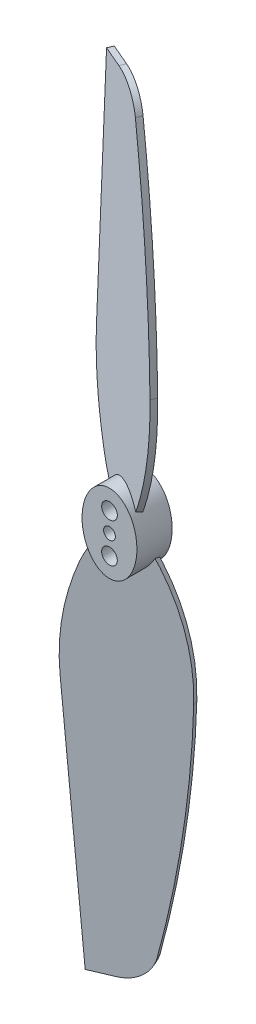
ISO-10303-21;
HEADER;
FILE_DESCRIPTION(('STEP AP214'),'2;1');
FILE_NAME('part.step','',(''),(''),'','','');
FILE_SCHEMA(('AUTOMOTIVE_DESIGN { 1 0 10303 214 1 1 1 1 }'));
ENDSEC;
DATA;
#1=APPLICATION_CONTEXT('core data for automotive mechanical design processes');
#2=APPLICATION_PROTOCOL_DEFINITION('international standard','automotive_design',2000,#1);
#3=PRODUCT_CONTEXT('',#1,'mechanical');
#4=PRODUCT('Part','Part','',(#3));
#5=PRODUCT_RELATED_PRODUCT_CATEGORY('part','',(#4));
#6=PRODUCT_DEFINITION_FORMATION('','',#4);
#7=PRODUCT_DEFINITION_CONTEXT('part definition',#1,'design');
#8=PRODUCT_DEFINITION('design','',#6,#7);
#9=PRODUCT_DEFINITION_SHAPE('','',#8);
#10=(LENGTH_UNIT() NAMED_UNIT(*) SI_UNIT(.MILLI.,.METRE.));
#11=(NAMED_UNIT(*) PLANE_ANGLE_UNIT() SI_UNIT($,.RADIAN.));
#12=(NAMED_UNIT(*) SI_UNIT($,.STERADIAN.) SOLID_ANGLE_UNIT());
#13=UNCERTAINTY_MEASURE_WITH_UNIT(LENGTH_MEASURE(1.E-05),#10,'distance_accuracy_value','');
#14=(GEOMETRIC_REPRESENTATION_CONTEXT(3) GLOBAL_UNCERTAINTY_ASSIGNED_CONTEXT((#13)) GLOBAL_UNIT_ASSIGNED_CONTEXT((#10,
#11,#12)) REPRESENTATION_CONTEXT('',''));
#15=CARTESIAN_POINT('',(0.,0.,0.));
#16=DIRECTION('',(0.,0.,1.));
#17=DIRECTION('',(1.,0.,0.));
#18=AXIS2_PLACEMENT_3D('',#15,#16,#17);
#19=CARTESIAN_POINT('',(0.,0.,4.5));
#20=DIRECTION('',(0.,0.,1.));
#21=DIRECTION('',(0.,1.,0.));
#22=AXIS2_PLACEMENT_3D('',#19,#20,#21);
#23=ELLIPSE('',#22,5.,3.5);
#24=DIRECTION('',(0.,0.,-1.));
#25=VECTOR('',#24,1.);
#26=SURFACE_OF_LINEAR_EXTRUSION('',#23,#25);
#27=CARTESIAN_POINT('',(0.,0.,0.));
#28=DIRECTION('',(0.,0.,1.));
#29=DIRECTION('',(0.,1.,0.));
#30=AXIS2_PLACEMENT_3D('',#27,#28,#29);
#31=ELLIPSE('',#30,5.,3.5);
#32=CARTESIAN_POINT('',(0.,5.,0.));
#33=VERTEX_POINT('',#32);
#34=EDGE_CURVE('E66',#33,#33,#31,.T.);
#35=ORIENTED_EDGE('',*,*,#34,.T.);
#36=EDGE_LOOP('',(#35));
#37=FACE_BOUND('',#36,.T.);
#38=CARTESIAN_POINT('',(0.,5.,4.5));
#39=VERTEX_POINT('',#38);
#40=EDGE_CURVE('E11',#39,#39,#23,.T.);
#41=ORIENTED_EDGE('',*,*,#40,.F.);
#42=EDGE_LOOP('',(#41));
#43=FACE_BOUND('',#42,.T.);
#44=ADVANCED_FACE('F58',(#37,#43),#26,.F.);
#45=CARTESIAN_POINT('',(0.,0.,4.5));
#46=DIRECTION('',(0.,0.,1.));
#47=DIRECTION('',(1.,0.,0.));
#48=AXIS2_PLACEMENT_3D('',#45,#46,#47);
#49=PLANE('',#48);
#50=CARTESIAN_POINT('',(0.,0.,4.5));
#51=DIRECTION('',(0.,0.,1.));
#52=DIRECTION('',(1.,0.,0.));
#53=AXIS2_PLACEMENT_3D('',#50,#51,#52);
#54=CIRCLE('',#53,0.75);
#55=CARTESIAN_POINT('',(0.75,0.,4.5));
#56=VERTEX_POINT('',#55);
#57=EDGE_CURVE('E79',#56,#56,#54,.T.);
#58=ORIENTED_EDGE('',*,*,#57,.F.);
#59=EDGE_LOOP('',(#58));
#60=FACE_BOUND('',#59,.T.);
#61=CARTESIAN_POINT('',(0.,2.5,4.5));
#62=DIRECTION('',(0.,0.,1.));
#63=DIRECTION('',(1.,0.,0.));
#64=AXIS2_PLACEMENT_3D('',#61,#62,#63);
#65=CIRCLE('',#64,1.);
#66=CARTESIAN_POINT('',(1.,2.5,4.5));
#67=VERTEX_POINT('',#66);
#68=EDGE_CURVE('E125',#67,#67,#65,.T.);
#69=ORIENTED_EDGE('',*,*,#68,.F.);
#70=EDGE_LOOP('',(#69));
#71=FACE_BOUND('',#70,.T.);
#72=CARTESIAN_POINT('',(0.,-2.5,4.5));
#73=DIRECTION('',(0.,0.,1.));
#74=DIRECTION('',(1.,0.,0.));
#75=AXIS2_PLACEMENT_3D('',#72,#73,#74);
#76=CIRCLE('',#75,1.);
#77=CARTESIAN_POINT('',(1.,-2.5,4.5));
#78=VERTEX_POINT('',#77);
#79=EDGE_CURVE('E73',#78,#78,#76,.T.);
#80=ORIENTED_EDGE('',*,*,#79,.F.);
#81=EDGE_LOOP('',(#80));
#82=FACE_BOUND('',#81,.T.);
#83=ORIENTED_EDGE('',*,*,#40,.T.);
#84=EDGE_LOOP('',(#83));
#85=FACE_BOUND('',#84,.T.);
#86=ADVANCED_FACE('F101',(#60,#71,#82,#85),#49,.T.);
#87=CARTESIAN_POINT('',(0.,0.,0.));
#88=DIRECTION('',(0.,0.,1.));
#89=DIRECTION('',(1.,0.,0.));
#90=AXIS2_PLACEMENT_3D('',#87,#88,#89);
#91=PLANE('',#90);
#92=CARTESIAN_POINT('',(0.,0.,0.));
#93=DIRECTION('',(0.,0.,1.));
#94=DIRECTION('',(1.,0.,0.));
#95=AXIS2_PLACEMENT_3D('',#92,#93,#94);
#96=CIRCLE('',#95,0.75);
#97=CARTESIAN_POINT('',(0.75,0.,0.));
#98=VERTEX_POINT('',#97);
#99=EDGE_CURVE('E62',#98,#98,#96,.T.);
#100=ORIENTED_EDGE('',*,*,#99,.T.);
#101=EDGE_LOOP('',(#100));
#102=FACE_BOUND('',#101,.T.);
#103=CARTESIAN_POINT('',(0.,2.5,0.));
#104=DIRECTION('',(0.,0.,1.));
#105=DIRECTION('',(1.,0.,0.));
#106=AXIS2_PLACEMENT_3D('',#103,#104,#105);
#107=CIRCLE('',#106,1.);
#108=CARTESIAN_POINT('',(1.,2.5,0.));
#109=VERTEX_POINT('',#108);
#110=EDGE_CURVE('E78',#109,#109,#107,.T.);
#111=ORIENTED_EDGE('',*,*,#110,.T.);
#112=EDGE_LOOP('',(#111));
#113=FACE_BOUND('',#112,.T.);
#114=CARTESIAN_POINT('',(0.,-2.5,0.));
#115=DIRECTION('',(0.,0.,1.));
#116=DIRECTION('',(1.,0.,0.));
#117=AXIS2_PLACEMENT_3D('',#114,#115,#116);
#118=CIRCLE('',#117,1.);
#119=CARTESIAN_POINT('',(1.,-2.5,0.));
#120=VERTEX_POINT('',#119);
#121=EDGE_CURVE('E76',#120,#120,#118,.T.);
#122=ORIENTED_EDGE('',*,*,#121,.T.);
#123=EDGE_LOOP('',(#122));
#124=FACE_BOUND('',#123,.T.);
#125=ORIENTED_EDGE('',*,*,#34,.F.);
#126=EDGE_LOOP('',(#125));
#127=FACE_BOUND('',#126,.T.);
#128=ADVANCED_FACE('F86',(#102,#113,#124,#127),#91,.F.);
#129=CARTESIAN_POINT('',(0.,-2.5,-0.689462870256029));
#130=DIRECTION('',(0.,0.,1.));
#131=DIRECTION('',(1.,0.,0.));
#132=AXIS2_PLACEMENT_3D('',#129,#130,#131);
#133=CYLINDRICAL_SURFACE('',#132,1.);
#134=ORIENTED_EDGE('',*,*,#79,.T.);
#135=EDGE_LOOP('',(#134));
#136=FACE_BOUND('',#135,.T.);
#137=ORIENTED_EDGE('',*,*,#121,.F.);
#138=EDGE_LOOP('',(#137));
#139=FACE_BOUND('',#138,.T.);
#140=ADVANCED_FACE('F96',(#136,#139),#133,.F.);
#141=CARTESIAN_POINT('',(0.,2.5,-0.689462870256029));
#142=DIRECTION('',(0.,0.,1.));
#143=DIRECTION('',(1.,0.,0.));
#144=AXIS2_PLACEMENT_3D('',#141,#142,#143);
#145=CYLINDRICAL_SURFACE('',#144,1.);
#146=ORIENTED_EDGE('',*,*,#68,.T.);
#147=EDGE_LOOP('',(#146));
#148=FACE_BOUND('',#147,.T.);
#149=ORIENTED_EDGE('',*,*,#110,.F.);
#150=EDGE_LOOP('',(#149));
#151=FACE_BOUND('',#150,.T.);
#152=ADVANCED_FACE('F90',(#148,#151),#145,.F.);
#153=CARTESIAN_POINT('',(0.,0.,-0.689462870256029));
#154=DIRECTION('',(0.,0.,1.));
#155=DIRECTION('',(1.,0.,0.));
#156=AXIS2_PLACEMENT_3D('',#153,#154,#155);
#157=CYLINDRICAL_SURFACE('',#156,0.75);
#158=ORIENTED_EDGE('',*,*,#57,.T.);
#159=EDGE_LOOP('',(#158));
#160=FACE_BOUND('',#159,.T.);
#161=ORIENTED_EDGE('',*,*,#99,.F.);
#162=EDGE_LOOP('',(#161));
#163=FACE_BOUND('',#162,.T.);
#164=ADVANCED_FACE('F88',(#160,#163),#157,.F.);
#165=CLOSED_SHELL('',(#44,#86,#128,#140,#152,#164));
#166=MANIFOLD_SOLID_BREP('B2',#165);
#167=CARTESIAN_POINT('',(1.3145287411941,0.,2.27814653766199));
#168=DIRECTION('',(0.,1.,0.));
#169=DIRECTION('',(-0.724137930705924,0.,-0.68965517275878));
#170=AXIS2_PLACEMENT_3D('',#167,#168,#169);
#171=PLANE('',#170);
#172=DIRECTION('',(0.,0.,1.));
#173=VECTOR('',#172,1.);
#174=CARTESIAN_POINT('',(-0.75,0.,-0.689462870256029));
#175=LINE('',#174,#173);
#176=CARTESIAN_POINT('',(-0.749999999999999,0.,2.34696887869071));
#177=VERTEX_POINT('',#176);
#178=CARTESIAN_POINT('',(-0.75,0.,2.53809487809043));
#179=VERTEX_POINT('',#178);
#180=EDGE_CURVE('E331',#177,#179,#175,.T.);
#181=ORIENTED_EDGE('',*,*,#180,.F.);
#182=DIRECTION('',(-0.919145030205725,0.,0.393919298141278));
#183=VECTOR('',#182,1.);
#184=CARTESIAN_POINT('',(1.01908926758814,0.,1.5887877650077));
#185=LINE('',#184,#183);
#186=CARTESIAN_POINT('',(-0.819200792823308,0.,2.37662636129025));
#187=VERTEX_POINT('',#186);
#188=EDGE_CURVE('E305',#177,#187,#185,.T.);
#189=ORIENTED_EDGE('',*,*,#188,.T.);
#190=DIRECTION('',(-0.393919298141278,0.,-0.919145030205725));
#191=VECTOR('',#190,1.);
#192=CARTESIAN_POINT('',(-0.52376131921735,0.,3.06598513394455));
#193=LINE('',#192,#191);
#194=EDGE_CURVE('E312',#179,#187,#193,.T.);
#195=ORIENTED_EDGE('',*,*,#194,.F.);
#196=EDGE_LOOP('',(#181,#189,#195));
#197=FACE_BOUND('',#196,.T.);
#198=ADVANCED_FACE('F181',(#197),#171,.T.);
#199=CARTESIAN_POINT('',(21.9152398199257,-15.7156926478818,-6.55072962732023));
#200=DIRECTION('',(-0.393919298141278,0.,-0.919145030205725));
#201=DIRECTION('',(-0.919145030205725,0.,0.393919298141278));
#202=AXIS2_PLACEMENT_3D('',#199,#200,#201);
#203=CYLINDRICAL_SURFACE('',#202,30.);
#204=CARTESIAN_POINT('',(21.6198003463197,-15.7156926478818,-7.24008839997453));
#205=DIRECTION('',(0.393919298141278,0.,0.919145030205725));
#206=DIRECTION('',(-0.919145030205725,0.,0.393919298141278));
#207=AXIS2_PLACEMENT_3D('',#204,#205,#206);
#208=CIRCLE('',#207,30.);
#209=CARTESIAN_POINT('',(-4.13552137977223,-5.,3.79790661096967));
#210=VERTEX_POINT('',#209);
#211=CARTESIAN_POINT('',(-5.8744984589548,-18.,4.54318250106728));
#212=VERTEX_POINT('',#211);
#213=EDGE_CURVE('E291',#210,#212,#208,.T.);
#214=ORIENTED_EDGE('',*,*,#213,.T.);
#215=DIRECTION('',(-0.393919298141278,0.,-0.919145030205725));
#216=VECTOR('',#215,1.);
#217=CARTESIAN_POINT('',(-5.57905898534884,-18.,5.23254127372158));
#218=LINE('',#217,#216);
#219=CARTESIAN_POINT('',(-5.57905898534884,-18.,5.23254127372158));
#220=VERTEX_POINT('',#219);
#221=EDGE_CURVE('E290',#220,#212,#218,.T.);
#222=ORIENTED_EDGE('',*,*,#221,.F.);
#223=CARTESIAN_POINT('',(21.9152398199257,-15.7156926478818,-6.55072962732023));
#224=DIRECTION('',(0.393919298141278,0.,0.919145030205725));
#225=DIRECTION('',(-0.919145030205725,0.,0.393919298141278));
#226=AXIS2_PLACEMENT_3D('',#223,#224,#225);
#227=CIRCLE('',#226,30.);
#228=CARTESIAN_POINT('',(-3.84008190616627,-5.,4.48726538362396));
#229=VERTEX_POINT('',#228);
#230=EDGE_CURVE('E310',#229,#220,#227,.T.);
#231=ORIENTED_EDGE('',*,*,#230,.F.);
#232=DIRECTION('',(-0.393919298141278,0.,-0.919145030205725));
#233=VECTOR('',#232,1.);
#234=CARTESIAN_POINT('',(-3.84008190616627,-5.,4.48726538362396));
#235=LINE('',#234,#233);
#236=EDGE_CURVE('E189',#229,#210,#235,.T.);
#237=ORIENTED_EDGE('',*,*,#236,.T.);
#238=EDGE_LOOP('',(#214,#222,#231,#237));
#239=FACE_BOUND('',#238,.T.);
#240=ADVANCED_FACE('F183',(#239),#203,.T.);
#241=CARTESIAN_POINT('',(6.46204678427051,-9.28627705915271,0.0720673792462853));
#242=DIRECTION('',(-0.393919298141278,0.,-0.919145030205725));
#243=DIRECTION('',(-0.919145030205725,0.,0.393919298141278));
#244=AXIS2_PLACEMENT_3D('',#241,#242,#243);
#245=CYLINDRICAL_SURFACE('',#244,12.);
#246=CARTESIAN_POINT('',(-0.75,0.,2.53809487809043));
#247=CARTESIAN_POINT('',(-0.749996468598497,-0.0164378048235438,2.58908687690633));
#248=CARTESIAN_POINT('',(-0.749459645822779,-0.0326092065875987,2.64016267214185));
#249=CARTESIAN_POINT('',(-0.747397567067205,-0.0644396910591233,2.74243276950829));
#250=CARTESIAN_POINT('',(-0.745872686743596,-0.0800989660995931,2.79362701923538));
#251=CARTESIAN_POINT('',(-0.741912546858403,-0.110937937879825,2.89612307861109));
#252=CARTESIAN_POINT('',(-0.739477298974362,-0.126117640768485,2.94742488687164));
#253=CARTESIAN_POINT('',(-0.733750101990573,-0.15601889722111,3.05013551591533));
#254=CARTESIAN_POINT('',(-0.730457827728856,-0.170740274514427,3.10154436995264));
#255=CARTESIAN_POINT('',(-0.726764836807171,-0.185237339596115,3.15298664136786));
#256=B_SPLINE_CURVE_WITH_KNOTS('',3,(#246,#247,#248,#249,#250,#251,#252,#253,#254,#255),
.UNSPECIFIED.,.F.,.F.,(4,2,2,2,4),(0.,0.160721728299978,0.321382386550923,0.482040984032935,
0.642760625609639),.UNSPECIFIED.);
#257=CARTESIAN_POINT('',(-0.726764836806105,-0.185237339595355,3.15298664136811));
#258=VERTEX_POINT('',#257);
#259=EDGE_CURVE('E336',#179,#258,#256,.T.);
#260=ORIENTED_EDGE('',*,*,#259,.F.);
#261=ORIENTED_EDGE('',*,*,#194,.T.);
#262=CARTESIAN_POINT('',(6.16660731066455,-9.28627705915271,-0.61729139340801));
#263=DIRECTION('',(0.393919298141278,0.,0.919145030205725));
#264=DIRECTION('',(-0.919145030205725,0.,0.393919298141278));
#265=AXIS2_PLACEMENT_3D('',#262,#263,#264);
#266=CIRCLE('',#265,12.);
#267=EDGE_CURVE('E237',#187,#210,#266,.T.);
#268=ORIENTED_EDGE('',*,*,#267,.T.);
#269=ORIENTED_EDGE('',*,*,#236,.F.);
#270=CARTESIAN_POINT('',(6.46204678427051,-9.28627705915271,0.0720673792462853));
#271=DIRECTION('',(0.393919298141278,0.,0.919145030205725));
#272=DIRECTION('',(-0.919145030205725,0.,0.393919298141278));
#273=AXIS2_PLACEMENT_3D('',#270,#271,#272);
#274=CIRCLE('',#273,12.);
#275=EDGE_CURVE('E204',#258,#229,#274,.T.);
#276=ORIENTED_EDGE('',*,*,#275,.F.);
#277=EDGE_LOOP('',(#260,#261,#268,#269,#276));
#278=FACE_BOUND('',#277,.T.);
#279=ADVANCED_FACE('F346',(#278),#245,.T.);
#280=DIRECTION('',(0.,0.,1.));
#281=VECTOR('',#280,1.);
#282=CARTESIAN_POINT('',(0.75,0.,-0.689462870256029));
#283=LINE('',#282,#281);
#284=CARTESIAN_POINT('',(0.75,0.,2.52008742642683));
#285=VERTEX_POINT('',#284);
#286=CARTESIAN_POINT('',(0.750000000000001,0.,1.70411173667944));
#287=VERTEX_POINT('',#286);
#288=EDGE_CURVE('E195',#285,#287,#283,.F.);
#289=ORIENTED_EDGE('',*,*,#288,.F.);
#290=DIRECTION('',(-0.919145030205725,0.,0.393919298141278));
#291=VECTOR('',#290,1.);
#292=CARTESIAN_POINT('',(1.3145287411941,0.,2.27814653766199));
#293=LINE('',#292,#291);
#294=CARTESIAN_POINT('',(1.31452874119409,0.,2.278146537662));
#295=VERTEX_POINT('',#294);
#296=EDGE_CURVE('E284',#295,#285,#293,.T.);
#297=ORIENTED_EDGE('',*,*,#296,.F.);
#298=DIRECTION('',(-0.393919298141278,0.,-0.919145030205725));
#299=VECTOR('',#298,1.);
#300=CARTESIAN_POINT('',(1.31452874119409,0.,2.278146537662));
#301=LINE('',#300,#299);
#302=CARTESIAN_POINT('',(1.01908926758813,0.,1.5887877650077));
#303=VERTEX_POINT('',#302);
#304=EDGE_CURVE('E278',#295,#303,#301,.T.);
#305=ORIENTED_EDGE('',*,*,#304,.T.);
#306=EDGE_CURVE('E306',#303,#287,#185,.T.);
#307=ORIENTED_EDGE('',*,*,#306,.T.);
#308=EDGE_LOOP('',(#289,#297,#305,#307));
#309=FACE_BOUND('',#308,.T.);
#310=ADVANCED_FACE('F367',(#309),#171,.T.);
#311=CARTESIAN_POINT('',(-21.197524437125,-17.3240618265888,11.9261693156753));
#312=DIRECTION('',(-0.393919298141278,0.,-0.919145030205725));
#313=DIRECTION('',(-0.919145030205725,0.,0.393919298141278));
#314=AXIS2_PLACEMENT_3D('',#311,#312,#313);
#315=CYLINDRICAL_SURFACE('',#314,30.);
#316=CARTESIAN_POINT('',(-21.4929639107309,-17.3240618265888,11.236810543021));
#317=DIRECTION('',(-0.393919298141278,0.,-0.919145030205725));
#318=DIRECTION('',(0.919145030205725,0.,-0.393919298141278));
#319=AXIS2_PLACEMENT_3D('',#316,#317,#318);
#320=CIRCLE('',#319,30.);
#321=CARTESIAN_POINT('',(6.07438693371967,-18.,-0.577768374769338));
#322=VERTEX_POINT('',#321);
#323=EDGE_CURVE('E303',#303,#322,#320,.T.);
#324=ORIENTED_EDGE('',*,*,#323,.F.);
#325=ORIENTED_EDGE('',*,*,#304,.F.);
#326=CARTESIAN_POINT('',(-21.197524437125,-17.3240618265888,11.9261693156753));
#327=DIRECTION('',(-0.393919298141278,0.,-0.919145030205725));
#328=DIRECTION('',(0.919145030205725,0.,-0.393919298141278));
#329=AXIS2_PLACEMENT_3D('',#326,#327,#328);
#330=CIRCLE('',#329,30.);
#331=CARTESIAN_POINT('',(6.36982640732562,-18.,0.111590397884956));
#332=VERTEX_POINT('',#331);
#333=EDGE_CURVE('E263',#295,#332,#330,.T.);
#334=ORIENTED_EDGE('',*,*,#333,.T.);
#335=DIRECTION('',(-0.393919298141278,0.,-0.919145030205725));
#336=VECTOR('',#335,1.);
#337=CARTESIAN_POINT('',(6.36982640732562,-18.,0.111590397884956));
#338=LINE('',#337,#336);
#339=EDGE_CURVE('E272',#332,#322,#338,.T.);
#340=ORIENTED_EDGE('',*,*,#339,.T.);
#341=EDGE_LOOP('',(#324,#325,#334,#340));
#342=FACE_BOUND('',#341,.T.);
#343=ADVANCED_FACE('F281',(#342),#315,.T.);
#344=CARTESIAN_POINT('',(-127.576836429602,-14.715692301252,57.5173029667481));
#345=DIRECTION('',(-0.393919298141278,0.,-0.919145030205725));
#346=DIRECTION('',(-0.919145030205725,0.,0.393919298141278));
#347=AXIS2_PLACEMENT_3D('',#344,#345,#346);
#348=CYLINDRICAL_SURFACE('',#347,145.766631976418);
#349=CARTESIAN_POINT('',(-127.872275903208,-14.715692301252,56.8279441940938));
#350=DIRECTION('',(-0.393919298141278,0.,-0.919145030205725));
#351=DIRECTION('',(0.919145030205725,0.,-0.393919298141278));
#352=AXIS2_PLACEMENT_3D('',#349,#350,#351);
#353=CIRCLE('',#352,145.766631976418);
#354=CARTESIAN_POINT('',(2.80562123359325,-46.8818098813125,0.823131209155812));
#355=VERTEX_POINT('',#354);
#356=EDGE_CURVE('E275',#322,#355,#353,.T.);
#357=ORIENTED_EDGE('',*,*,#356,.F.);
#358=ORIENTED_EDGE('',*,*,#339,.F.);
#359=CARTESIAN_POINT('',(-127.576836429602,-14.715692301252,57.5173029667481));
#360=DIRECTION('',(-0.393919298141278,0.,-0.919145030205725));
#361=DIRECTION('',(0.919145030205725,0.,-0.393919298141278));
#362=AXIS2_PLACEMENT_3D('',#359,#360,#361);
#363=CIRCLE('',#362,145.766631976418);
#364=CARTESIAN_POINT('',(3.10106070719921,-46.8818098813125,1.51248998181011));
#365=VERTEX_POINT('',#364);
#366=EDGE_CURVE('E258',#332,#365,#363,.T.);
#367=ORIENTED_EDGE('',*,*,#366,.T.);
#368=DIRECTION('',(-0.393919298141278,0.,-0.919145030205725));
#369=VECTOR('',#368,1.);
#370=CARTESIAN_POINT('',(3.10106070719921,-46.8818098813125,1.51248998181011));
#371=LINE('',#370,#369);
#372=EDGE_CURVE('E279',#365,#355,#371,.T.);
#373=ORIENTED_EDGE('',*,*,#372,.T.);
#374=EDGE_LOOP('',(#357,#358,#367,#373));
#375=FACE_BOUND('',#374,.T.);
#376=ADVANCED_FACE('F273',(#375),#348,.T.);
#377=CARTESIAN_POINT('',(-0.487208620676712,-45.9985641631131,3.05031969173346));
#378=DIRECTION('',(-0.393919298141278,0.,-0.919145030205725));
#379=DIRECTION('',(-0.919145030205725,0.,0.393919298141278));
#380=AXIS2_PLACEMENT_3D('',#377,#378,#379);
#381=CYLINDRICAL_SURFACE('',#380,4.00258916013318);
#382=CARTESIAN_POINT('',(-0.78264809428267,-45.9985641631131,2.36096091907916));
#383=DIRECTION('',(0.393919298141278,0.,0.919145030205725));
#384=DIRECTION('',(-0.919145030205725,0.,0.393919298141278));
#385=AXIS2_PLACEMENT_3D('',#382,#383,#384);
#386=CIRCLE('',#385,4.00258916013318);
#387=CARTESIAN_POINT('',(-0.870958887229646,-50.,2.39880840172092));
#388=VERTEX_POINT('',#387);
#389=EDGE_CURVE('E300',#388,#355,#386,.T.);
#390=ORIENTED_EDGE('',*,*,#389,.T.);
#391=ORIENTED_EDGE('',*,*,#372,.F.);
#392=CARTESIAN_POINT('',(-0.487208620676712,-45.9985641631131,3.05031969173346));
#393=DIRECTION('',(0.393919298141278,0.,0.919145030205725));
#394=DIRECTION('',(-0.919145030205725,0.,0.393919298141278));
#395=AXIS2_PLACEMENT_3D('',#392,#393,#394);
#396=CIRCLE('',#395,4.00258916013318);
#397=CARTESIAN_POINT('',(-0.575519413623688,-50.,3.08816717437522));
#398=VERTEX_POINT('',#397);
#399=EDGE_CURVE('E266',#398,#365,#396,.T.);
#400=ORIENTED_EDGE('',*,*,#399,.F.);
#401=DIRECTION('',(-0.393919298141278,0.,-0.919145030205725));
#402=VECTOR('',#401,1.);
#403=CARTESIAN_POINT('',(-0.575519413623688,-50.,3.08816717437522));
#404=LINE('',#403,#402);
#405=EDGE_CURVE('E316',#398,#388,#404,.T.);
#406=ORIENTED_EDGE('',*,*,#405,.T.);
#407=EDGE_LOOP('',(#390,#391,#400,#406));
#408=FACE_BOUND('',#407,.T.);
#409=ADVANCED_FACE('F399',(#408),#381,.T.);
#410=CARTESIAN_POINT('',(-0.575519413623688,-50.,3.08816717437522));
#411=DIRECTION('',(0.,1.,0.));
#412=DIRECTION('',(-0.724137930705924,0.,-0.68965517275878));
#413=AXIS2_PLACEMENT_3D('',#410,#411,#412);
#414=PLANE('',#413);
#415=DIRECTION('',(-0.919145030205725,0.,0.393919298141278));
#416=VECTOR('',#415,1.);
#417=CARTESIAN_POINT('',(-0.870958887229646,-50.,2.39880840172092));
#418=LINE('',#417,#416);
#419=CARTESIAN_POINT('',(-3.62839397784682,-50.,3.58056629614476));
#420=VERTEX_POINT('',#419);
#421=EDGE_CURVE('E297',#388,#420,#418,.T.);
#422=ORIENTED_EDGE('',*,*,#421,.F.);
#423=ORIENTED_EDGE('',*,*,#405,.F.);
#424=DIRECTION('',(-0.919145030205725,0.,0.393919298141278));
#425=VECTOR('',#424,1.);
#426=CARTESIAN_POINT('',(-0.575519413623688,-50.,3.08816717437522));
#427=LINE('',#426,#425);
#428=CARTESIAN_POINT('',(-3.33295450424086,-50.,4.26992506879905));
#429=VERTEX_POINT('',#428);
#430=EDGE_CURVE('E390',#398,#429,#427,.T.);
#431=ORIENTED_EDGE('',*,*,#430,.T.);
#432=DIRECTION('',(-0.393919298141278,0.,-0.919145030205725));
#433=VECTOR('',#432,1.);
#434=CARTESIAN_POINT('',(-3.33295450424086,-50.,4.26992506879905));
#435=LINE('',#434,#433);
#436=EDGE_CURVE('E319',#429,#420,#435,.T.);
#437=ORIENTED_EDGE('',*,*,#436,.T.);
#438=EDGE_LOOP('',(#422,#423,#431,#437));
#439=FACE_BOUND('',#438,.T.);
#440=ADVANCED_FACE('F396',(#439),#414,.F.);
#441=CARTESIAN_POINT('',(-5.57905898534884,-18.,5.23254127372158));
#442=DIRECTION('',(-0.916476626842484,-0.0761435784039412,0.392775696701394));
#443=DIRECTION('',(0.393919298141278,0.,0.919145030205725));
#444=AXIS2_PLACEMENT_3D('',#441,#442,#443);
#445=PLANE('',#444);
#446=DIRECTION('',(0.0699869916720625,-0.99709686363354,-0.0299944249628459));
#447=VECTOR('',#446,1.);
#448=CARTESIAN_POINT('',(-5.8744984589548,-18.,4.54318250106728));
#449=LINE('',#448,#447);
#450=EDGE_CURVE('E294',#212,#420,#449,.T.);
#451=ORIENTED_EDGE('',*,*,#450,.T.);
#452=ORIENTED_EDGE('',*,*,#436,.F.);
#453=DIRECTION('',(0.0699869916720625,-0.99709686363354,-0.0299944249628459));
#454=VECTOR('',#453,1.);
#455=CARTESIAN_POINT('',(-5.57905898534884,-18.,5.23254127372158));
#456=LINE('',#455,#454);
#457=EDGE_CURVE('E246',#220,#429,#456,.T.);
#458=ORIENTED_EDGE('',*,*,#457,.F.);
#459=ORIENTED_EDGE('',*,*,#221,.T.);
#460=EDGE_LOOP('',(#451,#452,#458,#459));
#461=FACE_BOUND('',#460,.T.);
#462=ADVANCED_FACE('F359',(#461),#445,.T.);
#463=CARTESIAN_POINT('',(21.9152398199257,-15.7156926478818,-6.55072962732023));
#464=DIRECTION('',(-0.393919298141278,0.,-0.919145030205725));
#465=DIRECTION('',(-0.919145030205725,0.,0.393919298141278));
#466=AXIS2_PLACEMENT_3D('',#463,#464,#465);
#467=PLANE('',#466);
#468=CARTESIAN_POINT('',(0.,-2.5,2.84151599743247));
#469=DIRECTION('',(-0.393919298141278,0.,-0.919145030205725));
#470=DIRECTION('',(-0.919145030205725,0.,0.393919298141278));
#471=AXIS2_PLACEMENT_3D('',#468,#469,#470);
#472=ELLIPSE('',#471,1.08796758632985,1.);
#473=CARTESIAN_POINT('',(-1.,-2.5,3.27008742543998));
#474=VERTEX_POINT('',#473);
#475=EDGE_CURVE('E324',#474,#474,#472,.T.);
#476=ORIENTED_EDGE('',*,*,#475,.T.);
#477=EDGE_LOOP('',(#476));
#478=FACE_BOUND('',#477,.T.);
#479=ORIENTED_EDGE('',*,*,#296,.T.);
#480=CARTESIAN_POINT('',(0.,0.,2.84151599743247));
#481=DIRECTION('',(-0.393919298141278,0.,-0.919145030205725));
#482=DIRECTION('',(-0.919145030205725,0.,0.393919298141278));
#483=AXIS2_PLACEMENT_3D('',#480,#481,#482);
#484=ELLIPSE('',#483,0.815975689747388,0.75);
#485=EDGE_CURVE('E295',#285,#258,#484,.T.);
#486=ORIENTED_EDGE('',*,*,#485,.T.);
#487=ORIENTED_EDGE('',*,*,#275,.T.);
#488=ORIENTED_EDGE('',*,*,#230,.T.);
#489=ORIENTED_EDGE('',*,*,#457,.T.);
#490=ORIENTED_EDGE('',*,*,#430,.F.);
#491=ORIENTED_EDGE('',*,*,#399,.T.);
#492=ORIENTED_EDGE('',*,*,#366,.F.);
#493=ORIENTED_EDGE('',*,*,#333,.F.);
#494=EDGE_LOOP('',(#479,#486,#487,#488,#489,#490,#491,#492,#493));
#495=FACE_BOUND('',#494,.T.);
#496=ADVANCED_FACE('F261',(#478,#495),#467,.F.);
#497=CARTESIAN_POINT('',(21.6198003463197,-15.7156926478818,-7.24008839997453));
#498=DIRECTION('',(-0.393919298141278,0.,-0.919145030205725));
#499=DIRECTION('',(-0.919145030205725,0.,0.393919298141278));
#500=AXIS2_PLACEMENT_3D('',#497,#498,#499);
#501=PLANE('',#500);
#502=CARTESIAN_POINT('',(0.,0.,2.02554030768508));
#503=DIRECTION('',(-0.393919298141278,0.,-0.919145030205725));
#504=DIRECTION('',(-0.919145030205725,0.,0.393919298141278));
#505=AXIS2_PLACEMENT_3D('',#502,#503,#504);
#506=ELLIPSE('',#505,0.815975689747388,0.75);
#507=EDGE_CURVE('E56',#287,#177,#506,.T.);
#508=ORIENTED_EDGE('',*,*,#507,.F.);
#509=ORIENTED_EDGE('',*,*,#306,.F.);
#510=ORIENTED_EDGE('',*,*,#323,.T.);
#511=ORIENTED_EDGE('',*,*,#356,.T.);
#512=ORIENTED_EDGE('',*,*,#389,.F.);
#513=ORIENTED_EDGE('',*,*,#421,.T.);
#514=ORIENTED_EDGE('',*,*,#450,.F.);
#515=ORIENTED_EDGE('',*,*,#213,.F.);
#516=ORIENTED_EDGE('',*,*,#267,.F.);
#517=ORIENTED_EDGE('',*,*,#188,.F.);
#518=EDGE_LOOP('',(#508,#509,#510,#511,#512,#513,#514,#515,#516,#517));
#519=FACE_BOUND('',#518,.T.);
#520=CARTESIAN_POINT('',(0.,-2.5,2.02554030768508));
#521=DIRECTION('',(-0.393919298141278,0.,-0.919145030205725));
#522=DIRECTION('',(-0.919145030205725,0.,0.393919298141278));
#523=AXIS2_PLACEMENT_3D('',#520,#521,#522);
#524=ELLIPSE('',#523,1.08796758632985,1.);
#525=CARTESIAN_POINT('',(-1.,-2.5,2.45411173569259));
#526=VERTEX_POINT('',#525);
#527=EDGE_CURVE('E322',#526,#526,#524,.T.);
#528=ORIENTED_EDGE('',*,*,#527,.F.);
#529=EDGE_LOOP('',(#528));
#530=FACE_BOUND('',#529,.T.);
#531=ADVANCED_FACE('F357',(#519,#530),#501,.T.);
#532=CARTESIAN_POINT('',(0.,-2.5,-0.689462870256029));
#533=DIRECTION('',(0.,0.,1.));
#534=DIRECTION('',(1.,0.,0.));
#535=AXIS2_PLACEMENT_3D('',#532,#533,#534);
#536=CYLINDRICAL_SURFACE('',#535,1.);
#537=ORIENTED_EDGE('',*,*,#527,.T.);
#538=EDGE_LOOP('',(#537));
#539=FACE_BOUND('',#538,.T.);
#540=ORIENTED_EDGE('',*,*,#475,.F.);
#541=EDGE_LOOP('',(#540));
#542=FACE_BOUND('',#541,.T.);
#543=ADVANCED_FACE('F354',(#539,#542),#536,.F.);
#544=CARTESIAN_POINT('',(0.,0.,-0.689462870256029));
#545=DIRECTION('',(0.,0.,1.));
#546=DIRECTION('',(1.,0.,0.));
#547=AXIS2_PLACEMENT_3D('',#544,#545,#546);
#548=CYLINDRICAL_SURFACE('',#547,0.75);
#549=ORIENTED_EDGE('',*,*,#288,.T.);
#550=ORIENTED_EDGE('',*,*,#507,.T.);
#551=ORIENTED_EDGE('',*,*,#180,.T.);
#552=ORIENTED_EDGE('',*,*,#259,.T.);
#553=ORIENTED_EDGE('',*,*,#485,.F.);
#554=EDGE_LOOP('',(#549,#550,#551,#552,#553));
#555=FACE_BOUND('',#554,.T.);
#556=ADVANCED_FACE('F350',(#555),#548,.F.);
#557=CLOSED_SHELL('',(#198,#240,#279,#310,#343,#376,#409,#440,#462,#496,#531,#543,#556));
#558=MANIFOLD_SOLID_BREP('B6',#557);
#559=CARTESIAN_POINT('',(0.771425293050869,0.,2.98859868483594));
#560=DIRECTION('',(0.,-1.,0.));
#561=DIRECTION('',(0.,0.,-1.));
#562=AXIS2_PLACEMENT_3D('',#559,#560,#561);
#563=PLANE('',#562);
#564=DIRECTION('',(0.,0.,1.));
#565=VECTOR('',#564,1.);
#566=CARTESIAN_POINT('',(0.75,0.,-0.689462870256029));
#567=LINE('',#566,#565);
#568=CARTESIAN_POINT('',(0.75,0.,2.16344072647158));
#569=VERTEX_POINT('',#568);
#570=CARTESIAN_POINT('',(0.75,0.,2.97941641638557));
#571=VERTEX_POINT('',#570);
#572=EDGE_CURVE('E702',#569,#571,#567,.T.);
#573=ORIENTED_EDGE('',*,*,#572,.F.);
#574=DIRECTION('',(-0.919145030018058,0.,-0.393919298579168));
#575=VECTOR('',#574,1.);
#576=CARTESIAN_POINT('',(1.06686476698524,0.,2.2992399123224));
#577=LINE('',#576,#575);
#578=CARTESIAN_POINT('',(1.06686476698523,0.,2.29923991232239));
#579=VERTEX_POINT('',#578);
#580=EDGE_CURVE('E636',#579,#569,#577,.T.);
#581=ORIENTED_EDGE('',*,*,#580,.F.);
#582=DIRECTION('',(0.393919298579168,0.,-0.919145030018058));
#583=VECTOR('',#582,1.);
#584=CARTESIAN_POINT('',(0.771425293050859,0.,2.98859868483594));
#585=LINE('',#584,#583);
#586=CARTESIAN_POINT('',(0.771425293050859,0.,2.98859868483594));
#587=VERTEX_POINT('',#586);
#588=EDGE_CURVE('E630',#587,#579,#585,.T.);
#589=ORIENTED_EDGE('',*,*,#588,.F.);
#590=DIRECTION('',(-0.919145030018058,0.,-0.393919298579168));
#591=VECTOR('',#590,1.);
#592=CARTESIAN_POINT('',(0.771425293050869,0.,2.98859868483594));
#593=LINE('',#592,#591);
#594=EDGE_CURVE('E634',#587,#571,#593,.T.);
#595=ORIENTED_EDGE('',*,*,#594,.T.);
#596=EDGE_LOOP('',(#573,#581,#589,#595));
#597=FACE_BOUND('',#596,.T.);
#598=ADVANCED_FACE('F550',(#597),#563,.T.);
#599=CARTESIAN_POINT('',(21.3721363675763,15.7156926478818,11.8174748596325));
#600=DIRECTION('',(0.393919298579168,0.,-0.919145030018058));
#601=DIRECTION('',(-0.919145030018058,0.,-0.393919298579168));
#602=AXIS2_PLACEMENT_3D('',#599,#600,#601);
#603=CYLINDRICAL_SURFACE('',#602,30.);
#604=CARTESIAN_POINT('',(21.6675758415107,15.7156926478818,11.128116087119));
#605=DIRECTION('',(0.393919298579168,0.,-0.919145030018058));
#606=DIRECTION('',(-0.919145030018058,0.,-0.393919298579168));
#607=AXIS2_PLACEMENT_3D('',#604,#605,#606);
#608=CIRCLE('',#607,30.);
#609=CARTESIAN_POINT('',(-4.08774587932268,5.,0.090121063904717));
#610=VERTEX_POINT('',#609);
#611=CARTESIAN_POINT('',(-5.82672295815019,18.,-0.65515482702136));
#612=VERTEX_POINT('',#611);
#613=EDGE_CURVE('E660',#610,#612,#608,.T.);
#614=ORIENTED_EDGE('',*,*,#613,.F.);
#615=DIRECTION('',(0.393919298579168,0.,-0.919145030018058));
#616=VECTOR('',#615,1.);
#617=CARTESIAN_POINT('',(-4.38318535325705,5.,0.779479836418261));
#618=LINE('',#617,#616);
#619=CARTESIAN_POINT('',(-4.38318535325705,5.,0.779479836418261));
#620=VERTEX_POINT('',#619);
#621=EDGE_CURVE('E558',#620,#610,#618,.T.);
#622=ORIENTED_EDGE('',*,*,#621,.F.);
#623=CARTESIAN_POINT('',(21.3721363675763,15.7156926478818,11.8174748596325));
#624=DIRECTION('',(0.393919298579168,0.,-0.919145030018058));
#625=DIRECTION('',(-0.919145030018058,0.,-0.393919298579168));
#626=AXIS2_PLACEMENT_3D('',#623,#624,#625);
#627=CIRCLE('',#626,30.);
#628=CARTESIAN_POINT('',(-6.12216243208456,18.,0.0342039454921836));
#629=VERTEX_POINT('',#628);
#630=EDGE_CURVE('E682',#620,#629,#627,.T.);
#631=ORIENTED_EDGE('',*,*,#630,.T.);
#632=DIRECTION('',(0.393919298579168,0.,-0.919145030018058));
#633=VECTOR('',#632,1.);
#634=CARTESIAN_POINT('',(-6.12216243208456,18.,0.0342039454921836));
#635=LINE('',#634,#633);
#636=EDGE_CURVE('E611',#629,#612,#635,.T.);
#637=ORIENTED_EDGE('',*,*,#636,.T.);
#638=EDGE_LOOP('',(#614,#622,#631,#637));
#639=FACE_BOUND('',#638,.T.);
#640=ADVANCED_FACE('F552',(#639),#603,.T.);
#641=CARTESIAN_POINT('',(5.91894333507628,9.28627705915271,5.19467784570398));
#642=DIRECTION('',(0.393919298579168,0.,-0.919145030018058));
#643=DIRECTION('',(-0.919145030018058,0.,-0.393919298579168));
#644=AXIS2_PLACEMENT_3D('',#641,#642,#643);
#645=CYLINDRICAL_SURFACE('',#644,12.);
#646=CARTESIAN_POINT('',(6.21438280901066,9.28627705915271,4.50531907319043));
#647=DIRECTION('',(0.393919298579168,0.,-0.919145030018058));
#648=DIRECTION('',(-0.919145030018058,0.,-0.393919298579168));
#649=AXIS2_PLACEMENT_3D('',#646,#647,#648);
#650=CIRCLE('',#649,12.);
#651=CARTESIAN_POINT('',(-0.771425293050871,0.,1.51140131516406));
#652=VERTEX_POINT('',#651);
#653=EDGE_CURVE('E679',#652,#610,#650,.T.);
#654=ORIENTED_EDGE('',*,*,#653,.F.);
#655=DIRECTION('',(0.393919298579168,0.,-0.919145030018058));
#656=VECTOR('',#655,1.);
#657=CARTESIAN_POINT('',(-1.06686476698525,0.,2.20076008767761));
#658=LINE('',#657,#656);
#659=CARTESIAN_POINT('',(-1.06686476698525,0.,2.20076008767761));
#660=VERTEX_POINT('',#659);
#661=EDGE_CURVE('E639',#660,#652,#658,.T.);
#662=ORIENTED_EDGE('',*,*,#661,.F.);
#663=CARTESIAN_POINT('',(5.91894333507628,9.28627705915271,5.19467784570398));
#664=DIRECTION('',(0.393919298579168,0.,-0.919145030018058));
#665=DIRECTION('',(-0.919145030018058,0.,-0.393919298579168));
#666=AXIS2_PLACEMENT_3D('',#663,#664,#665);
#667=CIRCLE('',#666,12.);
#668=EDGE_CURVE('E655',#660,#620,#667,.T.);
#669=ORIENTED_EDGE('',*,*,#668,.T.);
#670=ORIENTED_EDGE('',*,*,#621,.T.);
#671=EDGE_LOOP('',(#654,#662,#669,#670));
#672=FACE_BOUND('',#671,.T.);
#673=ADVANCED_FACE('F735',(#672),#645,.T.);
#674=DIRECTION('',(0.,0.,1.));
#675=VECTOR('',#674,1.);
#676=CARTESIAN_POINT('',(-0.75,0.,-0.689462870256029));
#677=LINE('',#676,#675);
#678=CARTESIAN_POINT('',(-0.75,0.,2.33655927352843));
#679=VERTEX_POINT('',#678);
#680=CARTESIAN_POINT('',(-0.75,0.,1.52058358361444));
#681=VERTEX_POINT('',#680);
#682=EDGE_CURVE('E564',#679,#681,#677,.F.);
#683=ORIENTED_EDGE('',*,*,#682,.F.);
#684=EDGE_CURVE('E648',#679,#660,#593,.T.);
#685=ORIENTED_EDGE('',*,*,#684,.T.);
#686=ORIENTED_EDGE('',*,*,#661,.T.);
#687=EDGE_CURVE('E677',#681,#652,#577,.T.);
#688=ORIENTED_EDGE('',*,*,#687,.F.);
#689=EDGE_LOOP('',(#683,#685,#686,#688));
#690=FACE_BOUND('',#689,.T.);
#691=ADVANCED_FACE('F739',(#690),#563,.T.);
#692=CARTESIAN_POINT('',(-21.7406278806718,17.3240618265888,-6.65942410390233));
#693=DIRECTION('',(0.393919298579168,0.,-0.919145030018058));
#694=DIRECTION('',(-0.919145030018058,0.,-0.393919298579168));
#695=AXIS2_PLACEMENT_3D('',#692,#693,#694);
#696=CYLINDRICAL_SURFACE('',#695,30.);
#697=CARTESIAN_POINT('',(-21.4451884067374,17.3240618265888,-7.34878287641588));
#698=DIRECTION('',(-0.393919298579168,0.,0.919145030018058));
#699=DIRECTION('',(0.919145030018058,0.,0.393919298579168));
#700=AXIS2_PLACEMENT_3D('',#697,#698,#699);
#701=CIRCLE('',#700,30.);
#702=CARTESIAN_POINT('',(6.12216243208459,18.,4.46579605450784));
#703=VERTEX_POINT('',#702);
#704=EDGE_CURVE('E675',#579,#703,#701,.T.);
#705=ORIENTED_EDGE('',*,*,#704,.T.);
#706=DIRECTION('',(0.393919298579168,0.,-0.919145030018058));
#707=VECTOR('',#706,1.);
#708=CARTESIAN_POINT('',(5.82672295815022,18.,5.15515482702139));
#709=LINE('',#708,#707);
#710=CARTESIAN_POINT('',(5.82672295815022,18.,5.15515482702139));
#711=VERTEX_POINT('',#710);
#712=EDGE_CURVE('E640',#711,#703,#709,.T.);
#713=ORIENTED_EDGE('',*,*,#712,.F.);
#714=CARTESIAN_POINT('',(-21.7406278806718,17.3240618265888,-6.65942410390233));
#715=DIRECTION('',(-0.393919298579168,0.,0.919145030018058));
#716=DIRECTION('',(0.919145030018058,0.,0.393919298579168));
#717=AXIS2_PLACEMENT_3D('',#714,#715,#716);
#718=CIRCLE('',#717,30.);
#719=EDGE_CURVE('E643',#587,#711,#718,.T.);
#720=ORIENTED_EDGE('',*,*,#719,.F.);
#721=ORIENTED_EDGE('',*,*,#588,.T.);
#722=EDGE_LOOP('',(#705,#713,#720,#721));
#723=FACE_BOUND('',#722,.T.);
#724=ADVANCED_FACE('F644',(#723),#696,.T.);
#725=CARTESIAN_POINT('',(-128.119939851429,14.715692301252,-52.2505578056553));
#726=DIRECTION('',(0.393919298579168,0.,-0.919145030018058));
#727=DIRECTION('',(-0.919145030018058,0.,-0.393919298579168));
#728=AXIS2_PLACEMENT_3D('',#725,#726,#727);
#729=CYLINDRICAL_SURFACE('',#728,145.766631976418);
#730=CARTESIAN_POINT('',(-127.824500377494,14.715692301252,-52.9399165781689));
#731=DIRECTION('',(-0.393919298579168,0.,0.919145030018058));
#732=DIRECTION('',(0.919145030018058,0.,0.393919298579168));
#733=AXIS2_PLACEMENT_3D('',#730,#731,#732);
#734=CIRCLE('',#733,145.766631976418);
#735=CARTESIAN_POINT('',(2.85339673262559,46.8818098813125,3.0648964690254));
#736=VERTEX_POINT('',#735);
#737=EDGE_CURVE('E672',#703,#736,#734,.T.);
#738=ORIENTED_EDGE('',*,*,#737,.T.);
#739=DIRECTION('',(0.393919298579168,0.,-0.919145030018058));
#740=VECTOR('',#739,1.);
#741=CARTESIAN_POINT('',(2.55795725869122,46.8818098813125,3.75425524153895));
#742=LINE('',#741,#740);
#743=CARTESIAN_POINT('',(2.55795725869122,46.8818098813125,3.75425524153895));
#744=VERTEX_POINT('',#743);
#745=EDGE_CURVE('E687',#744,#736,#742,.T.);
#746=ORIENTED_EDGE('',*,*,#745,.F.);
#747=CARTESIAN_POINT('',(-128.119939851429,14.715692301252,-52.2505578056553));
#748=DIRECTION('',(-0.393919298579168,0.,0.919145030018058));
#749=DIRECTION('',(0.919145030018058,0.,0.393919298579168));
#750=AXIS2_PLACEMENT_3D('',#747,#748,#749);
#751=CIRCLE('',#750,145.766631976418);
#752=EDGE_CURVE('E649',#711,#744,#751,.T.);
#753=ORIENTED_EDGE('',*,*,#752,.F.);
#754=ORIENTED_EDGE('',*,*,#712,.T.);
#755=EDGE_LOOP('',(#738,#746,#753,#754));
#756=FACE_BOUND('',#755,.T.);
#757=ADVANCED_FACE('F718',(#756),#729,.T.);
#758=CARTESIAN_POINT('',(-1.03031206845207,45.9985641631131,2.21642552990611));
#759=DIRECTION('',(0.393919298579168,0.,-0.919145030018058));
#760=DIRECTION('',(-0.919145030018058,0.,-0.393919298579168));
#761=AXIS2_PLACEMENT_3D('',#758,#759,#760);
#762=CYLINDRICAL_SURFACE('',#761,4.00258916013318);
#763=CARTESIAN_POINT('',(-0.734872594517696,45.9985641631131,1.52706675739257));
#764=DIRECTION('',(0.393919298579168,0.,-0.919145030018058));
#765=DIRECTION('',(-0.919145030018058,0.,-0.393919298579168));
#766=AXIS2_PLACEMENT_3D('',#763,#764,#765);
#767=CIRCLE('',#766,4.00258916013318);
#768=CARTESIAN_POINT('',(-0.823183387446642,50.,1.48921927470873));
#769=VERTEX_POINT('',#768);
#770=EDGE_CURVE('E669',#769,#736,#767,.T.);
#771=ORIENTED_EDGE('',*,*,#770,.F.);
#772=DIRECTION('',(0.393919298579168,0.,-0.919145030018058));
#773=VECTOR('',#772,1.);
#774=CARTESIAN_POINT('',(-1.11862286138102,50.,2.17857804722228));
#775=LINE('',#774,#773);
#776=CARTESIAN_POINT('',(-1.11862286138102,50.,2.17857804722228));
#777=VERTEX_POINT('',#776);
#778=EDGE_CURVE('E689',#777,#769,#775,.T.);
#779=ORIENTED_EDGE('',*,*,#778,.F.);
#780=CARTESIAN_POINT('',(-1.03031206845207,45.9985641631131,2.21642552990611));
#781=DIRECTION('',(0.393919298579168,0.,-0.919145030018058));
#782=DIRECTION('',(-0.919145030018058,0.,-0.393919298579168));
#783=AXIS2_PLACEMENT_3D('',#780,#781,#782);
#784=CIRCLE('',#783,4.00258916013318);
#785=EDGE_CURVE('E713',#777,#744,#784,.T.);
#786=ORIENTED_EDGE('',*,*,#785,.T.);
#787=ORIENTED_EDGE('',*,*,#745,.T.);
#788=EDGE_LOOP('',(#771,#779,#786,#787));
#789=FACE_BOUND('',#788,.T.);
#790=ADVANCED_FACE('F722',(#789),#762,.T.);
#791=CARTESIAN_POINT('',(-1.11862286138102,50.,2.17857804722228));
#792=DIRECTION('',(0.,-1.,0.));
#793=DIRECTION('',(0.,0.,-1.));
#794=AXIS2_PLACEMENT_3D('',#791,#792,#793);
#795=PLANE('',#794);
#796=DIRECTION('',(-0.919145030018058,0.,-0.393919298579168));
#797=VECTOR('',#796,1.);
#798=CARTESIAN_POINT('',(-0.823183387446642,50.,1.48921927470873));
#799=LINE('',#798,#797);
#800=CARTESIAN_POINT('',(-3.58061847750082,50.,0.307461378971229));
#801=VERTEX_POINT('',#800);
#802=EDGE_CURVE('E666',#769,#801,#799,.T.);
#803=ORIENTED_EDGE('',*,*,#802,.T.);
#804=DIRECTION('',(0.393919298579168,0.,-0.919145030018058));
#805=VECTOR('',#804,1.);
#806=CARTESIAN_POINT('',(-3.87605795143519,50.,0.996820151484772));
#807=LINE('',#806,#805);
#808=CARTESIAN_POINT('',(-3.87605795143519,50.,0.996820151484772));
#809=VERTEX_POINT('',#808);
#810=EDGE_CURVE('E691',#809,#801,#807,.T.);
#811=ORIENTED_EDGE('',*,*,#810,.F.);
#812=DIRECTION('',(-0.919145030018058,0.,-0.393919298579168));
#813=VECTOR('',#812,1.);
#814=CARTESIAN_POINT('',(-1.11862286138102,50.,2.17857804722228));
#815=LINE('',#814,#813);
#816=EDGE_CURVE('E711',#777,#809,#815,.T.);
#817=ORIENTED_EDGE('',*,*,#816,.F.);
#818=ORIENTED_EDGE('',*,*,#778,.T.);
#819=EDGE_LOOP('',(#803,#811,#817,#818));
#820=FACE_BOUND('',#819,.T.);
#821=ADVANCED_FACE('F727',(#820),#795,.F.);
#822=CARTESIAN_POINT('',(-6.12216243208456,18.,0.0342039454921836));
#823=DIRECTION('',(-0.916476626655362,0.0761435784039412,-0.392775697138012));
#824=DIRECTION('',(-0.393919298579168,0.,0.919145030018058));
#825=AXIS2_PLACEMENT_3D('',#822,#823,#824);
#826=PLANE('',#825);
#827=DIRECTION('',(0.0699869916577729,0.99709686363354,0.0299944249961884));
#828=VECTOR('',#827,1.);
#829=CARTESIAN_POINT('',(-5.82672295815019,18.,-0.65515482702136));
#830=LINE('',#829,#828);
#831=EDGE_CURVE('E663',#612,#801,#830,.T.);
#832=ORIENTED_EDGE('',*,*,#831,.F.);
#833=ORIENTED_EDGE('',*,*,#636,.F.);
#834=DIRECTION('',(0.0699869916577729,0.99709686363354,0.0299944249961884));
#835=VECTOR('',#834,1.);
#836=CARTESIAN_POINT('',(-6.12216243208456,18.,0.0342039454921836));
#837=LINE('',#836,#835);
#838=EDGE_CURVE('E709',#629,#809,#837,.T.);
#839=ORIENTED_EDGE('',*,*,#838,.T.);
#840=ORIENTED_EDGE('',*,*,#810,.T.);
#841=EDGE_LOOP('',(#832,#833,#839,#840));
#842=FACE_BOUND('',#841,.T.);
#843=ADVANCED_FACE('F729',(#842),#826,.T.);
#844=CARTESIAN_POINT('',(21.3721363675763,15.7156926478818,11.8174748596325));
#845=DIRECTION('',(0.393919298579168,0.,-0.919145030018058));
#846=DIRECTION('',(-0.919145030018058,0.,-0.393919298579168));
#847=AXIS2_PLACEMENT_3D('',#844,#845,#846);
#848=PLANE('',#847);
#849=CARTESIAN_POINT('',(0.,2.5,2.657987844957));
#850=DIRECTION('',(0.393919298579168,0.,-0.919145030018058));
#851=DIRECTION('',(0.919145030018058,0.,0.393919298579168));
#852=AXIS2_PLACEMENT_3D('',#849,#850,#851);
#853=ELLIPSE('',#852,1.08796758655199,1.);
#854=CARTESIAN_POINT('',(1.,2.5,3.08655927352842));
#855=VERTEX_POINT('',#854);
#856=EDGE_CURVE('E695',#855,#855,#853,.T.);
#857=ORIENTED_EDGE('',*,*,#856,.T.);
#858=EDGE_LOOP('',(#857));
#859=FACE_BOUND('',#858,.T.);
#860=ORIENTED_EDGE('',*,*,#684,.F.);
#861=CARTESIAN_POINT('',(0.,0.,2.657987844957));
#862=DIRECTION('',(0.393919298579168,0.,-0.919145030018058));
#863=DIRECTION('',(0.919145030018058,0.,0.393919298579168));
#864=AXIS2_PLACEMENT_3D('',#861,#862,#863);
#865=ELLIPSE('',#864,0.81597568991399,0.75);
#866=EDGE_CURVE('E654',#679,#571,#865,.T.);
#867=ORIENTED_EDGE('',*,*,#866,.T.);
#868=ORIENTED_EDGE('',*,*,#594,.F.);
#869=ORIENTED_EDGE('',*,*,#719,.T.);
#870=ORIENTED_EDGE('',*,*,#752,.T.);
#871=ORIENTED_EDGE('',*,*,#785,.F.);
#872=ORIENTED_EDGE('',*,*,#816,.T.);
#873=ORIENTED_EDGE('',*,*,#838,.F.);
#874=ORIENTED_EDGE('',*,*,#630,.F.);
#875=ORIENTED_EDGE('',*,*,#668,.F.);
#876=EDGE_LOOP('',(#860,#867,#868,#869,#870,#871,#872,#873,#874,#875));
#877=FACE_BOUND('',#876,.T.);
#878=ADVANCED_FACE('F653',(#859,#877),#848,.F.);
#879=CARTESIAN_POINT('',(21.6675758415107,15.7156926478818,11.128116087119));
#880=DIRECTION('',(0.393919298579168,0.,-0.919145030018058));
#881=DIRECTION('',(-0.919145030018058,0.,-0.393919298579168));
#882=AXIS2_PLACEMENT_3D('',#879,#880,#881);
#883=PLANE('',#882);
#884=CARTESIAN_POINT('',(0.,0.,1.84201215504301));
#885=DIRECTION('',(0.393919298579168,0.,-0.919145030018058));
#886=DIRECTION('',(0.919145030018058,0.,0.393919298579168));
#887=AXIS2_PLACEMENT_3D('',#884,#885,#886);
#888=ELLIPSE('',#887,0.81597568991399,0.75);
#889=EDGE_CURVE('E179',#681,#569,#888,.T.);
#890=ORIENTED_EDGE('',*,*,#889,.F.);
#891=ORIENTED_EDGE('',*,*,#687,.T.);
#892=ORIENTED_EDGE('',*,*,#653,.T.);
#893=ORIENTED_EDGE('',*,*,#613,.T.);
#894=ORIENTED_EDGE('',*,*,#831,.T.);
#895=ORIENTED_EDGE('',*,*,#802,.F.);
#896=ORIENTED_EDGE('',*,*,#770,.T.);
#897=ORIENTED_EDGE('',*,*,#737,.F.);
#898=ORIENTED_EDGE('',*,*,#704,.F.);
#899=ORIENTED_EDGE('',*,*,#580,.T.);
#900=EDGE_LOOP('',(#890,#891,#892,#893,#894,#895,#896,#897,#898,#899));
#901=FACE_BOUND('',#900,.T.);
#902=CARTESIAN_POINT('',(0.,2.5,1.84201215504301));
#903=DIRECTION('',(0.393919298579168,0.,-0.919145030018058));
#904=DIRECTION('',(0.919145030018058,0.,0.393919298579168));
#905=AXIS2_PLACEMENT_3D('',#902,#903,#904);
#906=ELLIPSE('',#905,1.08796758655199,1.);
#907=CARTESIAN_POINT('',(1.,2.5,2.27058358361443));
#908=VERTEX_POINT('',#907);
#909=EDGE_CURVE('E693',#908,#908,#906,.T.);
#910=ORIENTED_EDGE('',*,*,#909,.F.);
#911=EDGE_LOOP('',(#910));
#912=FACE_BOUND('',#911,.T.);
#913=ADVANCED_FACE('F731',(#901,#912),#883,.T.);
#914=CARTESIAN_POINT('',(0.,2.5,-0.689462870256029));
#915=DIRECTION('',(0.,0.,1.));
#916=DIRECTION('',(1.,0.,0.));
#917=AXIS2_PLACEMENT_3D('',#914,#915,#916);
#918=CYLINDRICAL_SURFACE('',#917,1.);
#919=ORIENTED_EDGE('',*,*,#909,.T.);
#920=EDGE_LOOP('',(#919));
#921=FACE_BOUND('',#920,.T.);
#922=ORIENTED_EDGE('',*,*,#856,.F.);
#923=EDGE_LOOP('',(#922));
#924=FACE_BOUND('',#923,.T.);
#925=ADVANCED_FACE('F816',(#921,#924),#918,.F.);
#926=CARTESIAN_POINT('',(0.,0.,-0.689462870256029));
#927=DIRECTION('',(0.,0.,1.));
#928=DIRECTION('',(1.,0.,0.));
#929=AXIS2_PLACEMENT_3D('',#926,#927,#928);
#930=CYLINDRICAL_SURFACE('',#929,0.75);
#931=ORIENTED_EDGE('',*,*,#682,.T.);
#932=ORIENTED_EDGE('',*,*,#889,.T.);
#933=ORIENTED_EDGE('',*,*,#572,.T.);
#934=ORIENTED_EDGE('',*,*,#866,.F.);
#935=EDGE_LOOP('',(#931,#932,#933,#934));
#936=FACE_BOUND('',#935,.T.);
#937=ADVANCED_FACE('F829',(#936),#930,.F.);
#938=CLOSED_SHELL('',(#598,#640,#673,#691,#724,#757,#790,#821,#843,#878,#913,#925,#937));
#939=MANIFOLD_SOLID_BREP('B50',#938);
#940=ADVANCED_BREP_SHAPE_REPRESENTATION('',(#18,#166,#558,#939),#14);
#941=SHAPE_DEFINITION_REPRESENTATION(#9,#940);
ENDSEC;
END-ISO-10303-21;
